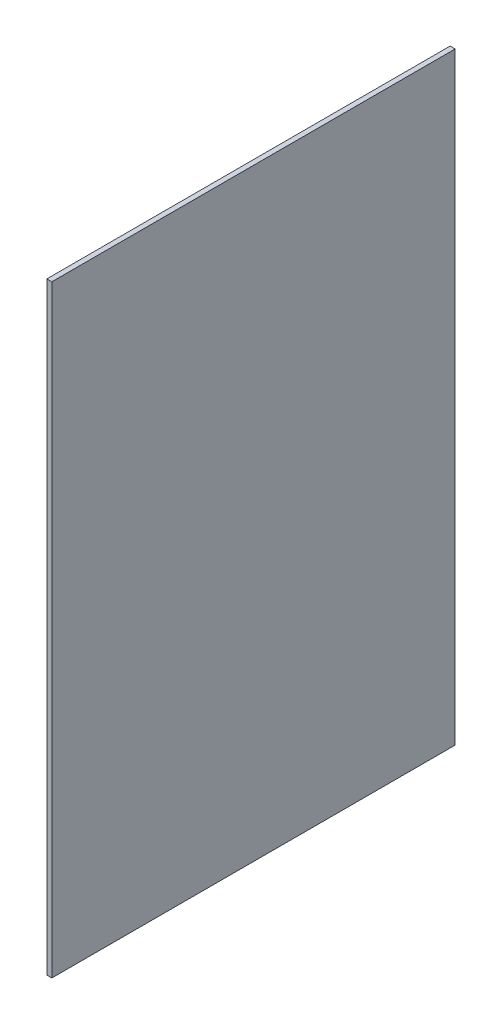
ISO-10303-21;
HEADER;
FILE_DESCRIPTION(('STEP AP214'),'2;1');
FILE_NAME('part.step','',(''),(''),'','','');
FILE_SCHEMA(('AUTOMOTIVE_DESIGN { 1 0 10303 214 1 1 1 1 }'));
ENDSEC;
DATA;
#1=APPLICATION_CONTEXT('core data for automotive mechanical design processes');
#2=APPLICATION_PROTOCOL_DEFINITION('international standard','automotive_design',2000,#1);
#3=PRODUCT_CONTEXT('',#1,'mechanical');
#4=PRODUCT('Part','Part','',(#3));
#5=PRODUCT_RELATED_PRODUCT_CATEGORY('part','',(#4));
#6=PRODUCT_DEFINITION_FORMATION('','',#4);
#7=PRODUCT_DEFINITION_CONTEXT('part definition',#1,'design');
#8=PRODUCT_DEFINITION('design','',#6,#7);
#9=PRODUCT_DEFINITION_SHAPE('','',#8);
#10=(LENGTH_UNIT() NAMED_UNIT(*) SI_UNIT(.MILLI.,.METRE.));
#11=(NAMED_UNIT(*) PLANE_ANGLE_UNIT() SI_UNIT($,.RADIAN.));
#12=(NAMED_UNIT(*) SI_UNIT($,.STERADIAN.) SOLID_ANGLE_UNIT());
#13=UNCERTAINTY_MEASURE_WITH_UNIT(LENGTH_MEASURE(1.E-05),#10,'distance_accuracy_value','');
#14=(GEOMETRIC_REPRESENTATION_CONTEXT(3) GLOBAL_UNCERTAINTY_ASSIGNED_CONTEXT((#13)) GLOBAL_UNIT_ASSIGNED_CONTEXT((#10,
#11,#12)) REPRESENTATION_CONTEXT('',''));
#15=CARTESIAN_POINT('',(0.,0.,0.));
#16=DIRECTION('',(0.,0.,1.));
#17=DIRECTION('',(1.,0.,0.));
#18=AXIS2_PLACEMENT_3D('',#15,#16,#17);
#19=CARTESIAN_POINT('',(177.8,-167.8,112.268));
#20=DIRECTION('',(0.,1.,0.));
#21=DIRECTION('',(0.,0.,1.));
#22=AXIS2_PLACEMENT_3D('',#19,#20,#21);
#23=PLANE('',#22);
#24=DIRECTION('',(1.,0.,0.));
#25=VECTOR('',#24,1.);
#26=CARTESIAN_POINT('',(177.8,-167.8,0.));
#27=LINE('',#26,#25);
#28=CARTESIAN_POINT('',(177.8,-167.8,0.));
#29=VERTEX_POINT('',#28);
#30=CARTESIAN_POINT('',(179.19446,-167.8,0.));
#31=VERTEX_POINT('',#30);
#32=EDGE_CURVE('E107',#29,#31,#27,.T.);
#33=ORIENTED_EDGE('',*,*,#32,.T.);
#34=DIRECTION('',(0.,0.,-1.));
#35=VECTOR('',#34,1.);
#36=CARTESIAN_POINT('',(179.19446,-167.8,112.268));
#37=LINE('',#36,#35);
#38=CARTESIAN_POINT('',(179.19446,-167.8,112.268));
#39=VERTEX_POINT('',#38);
#40=EDGE_CURVE('E11',#39,#31,#37,.T.);
#41=ORIENTED_EDGE('',*,*,#40,.F.);
#42=DIRECTION('',(1.,0.,0.));
#43=VECTOR('',#42,1.);
#44=CARTESIAN_POINT('',(177.8,-167.8,112.268));
#45=LINE('',#44,#43);
#46=CARTESIAN_POINT('',(177.8,-167.8,112.268));
#47=VERTEX_POINT('',#46);
#48=EDGE_CURVE('E91',#47,#39,#45,.T.);
#49=ORIENTED_EDGE('',*,*,#48,.F.);
#50=DIRECTION('',(0.,0.,-1.));
#51=VECTOR('',#50,1.);
#52=CARTESIAN_POINT('',(177.8,-167.8,112.268));
#53=LINE('',#52,#51);
#54=EDGE_CURVE('E103',#47,#29,#53,.T.);
#55=ORIENTED_EDGE('',*,*,#54,.T.);
#56=EDGE_LOOP('',(#33,#41,#49,#55));
#57=FACE_BOUND('',#56,.T.);
#58=ADVANCED_FACE('F39',(#57),#23,.F.);
#59=CARTESIAN_POINT('',(179.19446,0.,112.268));
#60=DIRECTION('',(-1.,0.,0.));
#61=DIRECTION('',(0.,-1.,0.));
#62=AXIS2_PLACEMENT_3D('',#59,#60,#61);
#63=PLANE('',#62);
#64=DIRECTION('',(0.,1.,0.));
#65=VECTOR('',#64,1.);
#66=CARTESIAN_POINT('',(179.19446,0.,0.));
#67=LINE('',#66,#65);
#68=CARTESIAN_POINT('',(179.19446,0.,0.));
#69=VERTEX_POINT('',#68);
#70=EDGE_CURVE('E96',#31,#69,#67,.T.);
#71=ORIENTED_EDGE('',*,*,#70,.T.);
#72=DIRECTION('',(0.,0.,-1.));
#73=VECTOR('',#72,1.);
#74=CARTESIAN_POINT('',(179.19446,0.,112.268));
#75=LINE('',#74,#73);
#76=CARTESIAN_POINT('',(179.19446,0.,112.268));
#77=VERTEX_POINT('',#76);
#78=EDGE_CURVE('E48',#77,#69,#75,.T.);
#79=ORIENTED_EDGE('',*,*,#78,.F.);
#80=DIRECTION('',(0.,1.,0.));
#81=VECTOR('',#80,1.);
#82=CARTESIAN_POINT('',(179.19446,0.,112.268));
#83=LINE('',#82,#81);
#84=EDGE_CURVE('E86',#39,#77,#83,.T.);
#85=ORIENTED_EDGE('',*,*,#84,.F.);
#86=ORIENTED_EDGE('',*,*,#40,.T.);
#87=EDGE_LOOP('',(#71,#79,#85,#86));
#88=FACE_BOUND('',#87,.T.);
#89=ADVANCED_FACE('F95',(#88),#63,.F.);
#90=CARTESIAN_POINT('',(177.8,0.,112.268));
#91=DIRECTION('',(0.,-1.,0.));
#92=DIRECTION('',(0.,0.,-1.));
#93=AXIS2_PLACEMENT_3D('',#90,#91,#92);
#94=PLANE('',#93);
#95=DIRECTION('',(-1.,0.,0.));
#96=VECTOR('',#95,1.);
#97=CARTESIAN_POINT('',(177.8,0.,0.));
#98=LINE('',#97,#96);
#99=CARTESIAN_POINT('',(177.8,0.,0.));
#100=VERTEX_POINT('',#99);
#101=EDGE_CURVE('E73',#69,#100,#98,.T.);
#102=ORIENTED_EDGE('',*,*,#101,.T.);
#103=DIRECTION('',(0.,0.,-1.));
#104=VECTOR('',#103,1.);
#105=CARTESIAN_POINT('',(177.8,0.,112.268));
#106=LINE('',#105,#104);
#107=CARTESIAN_POINT('',(177.8,0.,112.268));
#108=VERTEX_POINT('',#107);
#109=EDGE_CURVE('E98',#108,#100,#106,.T.);
#110=ORIENTED_EDGE('',*,*,#109,.F.);
#111=DIRECTION('',(-1.,0.,0.));
#112=VECTOR('',#111,1.);
#113=CARTESIAN_POINT('',(177.8,0.,112.268));
#114=LINE('',#113,#112);
#115=EDGE_CURVE('E89',#77,#108,#114,.T.);
#116=ORIENTED_EDGE('',*,*,#115,.F.);
#117=ORIENTED_EDGE('',*,*,#78,.T.);
#118=EDGE_LOOP('',(#102,#110,#116,#117));
#119=FACE_BOUND('',#118,.T.);
#120=ADVANCED_FACE('F99',(#119),#94,.F.);
#121=CARTESIAN_POINT('',(177.8,-167.8,112.268));
#122=DIRECTION('',(1.,0.,0.));
#123=DIRECTION('',(0.,1.,0.));
#124=AXIS2_PLACEMENT_3D('',#121,#122,#123);
#125=PLANE('',#124);
#126=DIRECTION('',(0.,-1.,0.));
#127=VECTOR('',#126,1.);
#128=CARTESIAN_POINT('',(177.8,-167.8,0.));
#129=LINE('',#128,#127);
#130=EDGE_CURVE('E79',#100,#29,#129,.T.);
#131=ORIENTED_EDGE('',*,*,#130,.T.);
#132=ORIENTED_EDGE('',*,*,#54,.F.);
#133=DIRECTION('',(0.,-1.,0.));
#134=VECTOR('',#133,1.);
#135=CARTESIAN_POINT('',(177.8,-167.8,112.268));
#136=LINE('',#135,#134);
#137=EDGE_CURVE('E56',#108,#47,#136,.T.);
#138=ORIENTED_EDGE('',*,*,#137,.F.);
#139=ORIENTED_EDGE('',*,*,#109,.T.);
#140=EDGE_LOOP('',(#131,#132,#138,#139));
#141=FACE_BOUND('',#140,.T.);
#142=ADVANCED_FACE('F120',(#141),#125,.F.);
#143=CARTESIAN_POINT('',(0.,0.,112.268));
#144=DIRECTION('',(0.,0.,-1.));
#145=DIRECTION('',(-1.,0.,0.));
#146=AXIS2_PLACEMENT_3D('',#143,#144,#145);
#147=PLANE('',#146);
#148=ORIENTED_EDGE('',*,*,#48,.T.);
#149=ORIENTED_EDGE('',*,*,#84,.T.);
#150=ORIENTED_EDGE('',*,*,#115,.T.);
#151=ORIENTED_EDGE('',*,*,#137,.T.);
#152=EDGE_LOOP('',(#148,#149,#150,#151));
#153=FACE_BOUND('',#152,.T.);
#154=ADVANCED_FACE('F87',(#153),#147,.F.);
#155=CARTESIAN_POINT('',(0.,0.,0.));
#156=DIRECTION('',(0.,0.,-1.));
#157=DIRECTION('',(-1.,0.,0.));
#158=AXIS2_PLACEMENT_3D('',#155,#156,#157);
#159=PLANE('',#158);
#160=ORIENTED_EDGE('',*,*,#32,.F.);
#161=ORIENTED_EDGE('',*,*,#130,.F.);
#162=ORIENTED_EDGE('',*,*,#101,.F.);
#163=ORIENTED_EDGE('',*,*,#70,.F.);
#164=EDGE_LOOP('',(#160,#161,#162,#163));
#165=FACE_BOUND('',#164,.T.);
#166=ADVANCED_FACE('F123',(#165),#159,.T.);
#167=CLOSED_SHELL('',(#58,#89,#120,#142,#154,#166));
#168=MANIFOLD_SOLID_BREP('B2',#167);
#169=ADVANCED_BREP_SHAPE_REPRESENTATION('',(#18,#168),#14);
#170=SHAPE_DEFINITION_REPRESENTATION(#9,#169);
ENDSEC;
END-ISO-10303-21;
